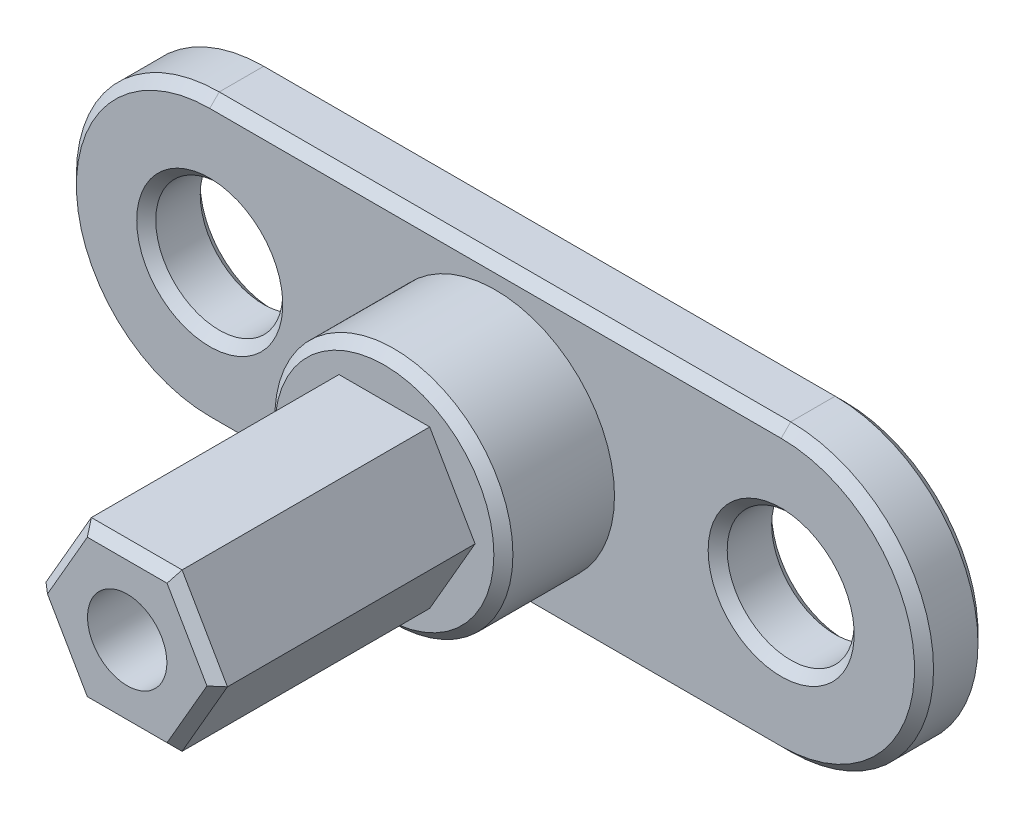
ISO-10303-21;
HEADER;
FILE_DESCRIPTION(('STEP AP214'),'2;1');
FILE_NAME('part.step','',(''),(''),'','','');
FILE_SCHEMA(('AUTOMOTIVE_DESIGN { 1 0 10303 214 1 1 1 1 }'));
ENDSEC;
DATA;
#1=APPLICATION_CONTEXT('core data for automotive mechanical design processes');
#2=APPLICATION_PROTOCOL_DEFINITION('international standard','automotive_design',2000,#1);
#3=PRODUCT_CONTEXT('',#1,'mechanical');
#4=PRODUCT('Part','Part','',(#3));
#5=PRODUCT_RELATED_PRODUCT_CATEGORY('part','',(#4));
#6=PRODUCT_DEFINITION_FORMATION('','',#4);
#7=PRODUCT_DEFINITION_CONTEXT('part definition',#1,'design');
#8=PRODUCT_DEFINITION('design','',#6,#7);
#9=PRODUCT_DEFINITION_SHAPE('','',#8);
#10=(LENGTH_UNIT() NAMED_UNIT(*) SI_UNIT(.MILLI.,.METRE.));
#11=(NAMED_UNIT(*) PLANE_ANGLE_UNIT() SI_UNIT($,.RADIAN.));
#12=(NAMED_UNIT(*) SI_UNIT($,.STERADIAN.) SOLID_ANGLE_UNIT());
#13=UNCERTAINTY_MEASURE_WITH_UNIT(LENGTH_MEASURE(1.E-05),#10,'distance_accuracy_value','');
#14=(GEOMETRIC_REPRESENTATION_CONTEXT(3) GLOBAL_UNCERTAINTY_ASSIGNED_CONTEXT((#13)) GLOBAL_UNIT_ASSIGNED_CONTEXT((#10,
#11,#12)) REPRESENTATION_CONTEXT('',''));
#15=CARTESIAN_POINT('',(0.,0.,0.));
#16=DIRECTION('',(0.,0.,1.));
#17=DIRECTION('',(1.,0.,0.));
#18=AXIS2_PLACEMENT_3D('',#15,#16,#17);
#19=CARTESIAN_POINT('',(-2.85788383248864,-4.95,16.2));
#20=DIRECTION('',(0.,1.,0.));
#21=DIRECTION('',(-1.,0.,0.));
#22=AXIS2_PLACEMENT_3D('',#19,#20,#21);
#23=PLANE('',#22);
#24=DIRECTION('',(0.,0.,-1.));
#25=VECTOR('',#24,1.);
#26=CARTESIAN_POINT('',(2.85788383248865,-4.95,16.2));
#27=LINE('',#26,#25);
#28=CARTESIAN_POINT('',(2.85788383248865,-4.95,15.6));
#29=VERTEX_POINT('',#28);
#30=CARTESIAN_POINT('',(2.85788383248865,-4.95,0.));
#31=VERTEX_POINT('',#30);
#32=EDGE_CURVE('E161',#29,#31,#27,.T.);
#33=ORIENTED_EDGE('',*,*,#32,.F.);
#34=DIRECTION('',(-1.,0.,0.));
#35=VECTOR('',#34,1.);
#36=CARTESIAN_POINT('',(-2.85788383248864,-4.95,15.6));
#37=LINE('',#36,#35);
#38=CARTESIAN_POINT('',(-2.85788383248864,-4.95,15.6));
#39=VERTEX_POINT('',#38);
#40=EDGE_CURVE('E233',#29,#39,#37,.T.);
#41=ORIENTED_EDGE('',*,*,#40,.T.);
#42=DIRECTION('',(0.,0.,-1.));
#43=VECTOR('',#42,1.);
#44=CARTESIAN_POINT('',(-2.85788383248864,-4.95,16.2));
#45=LINE('',#44,#43);
#46=CARTESIAN_POINT('',(-2.85788383248864,-4.95,0.));
#47=VERTEX_POINT('',#46);
#48=EDGE_CURVE('E186',#39,#47,#45,.T.);
#49=ORIENTED_EDGE('',*,*,#48,.T.);
#50=DIRECTION('',(1.,0.,0.));
#51=VECTOR('',#50,1.);
#52=CARTESIAN_POINT('',(-2.85788383248864,-4.95,0.));
#53=LINE('',#52,#51);
#54=EDGE_CURVE('E179',#47,#31,#53,.T.);
#55=ORIENTED_EDGE('',*,*,#54,.T.);
#56=EDGE_LOOP('',(#33,#41,#49,#55));
#57=FACE_BOUND('',#56,.T.);
#58=ADVANCED_FACE('F39',(#57),#23,.F.);
#59=CARTESIAN_POINT('',(2.85788383248865,-4.95,16.2));
#60=DIRECTION('',(-0.866025403784439,0.5,0.));
#61=DIRECTION('',(-0.5,-0.866025403784439,0.));
#62=AXIS2_PLACEMENT_3D('',#59,#60,#61);
#63=PLANE('',#62);
#64=DIRECTION('',(0.,0.,-1.));
#65=VECTOR('',#64,1.);
#66=CARTESIAN_POINT('',(5.7157676649773,0.,16.2));
#67=LINE('',#66,#65);
#68=CARTESIAN_POINT('',(5.7157676649773,0.,15.6));
#69=VERTEX_POINT('',#68);
#70=CARTESIAN_POINT('',(5.7157676649773,0.,0.));
#71=VERTEX_POINT('',#70);
#72=EDGE_CURVE('E172',#69,#71,#67,.T.);
#73=ORIENTED_EDGE('',*,*,#72,.F.);
#74=DIRECTION('',(-0.5,-0.866025403784439,0.));
#75=VECTOR('',#74,1.);
#76=CARTESIAN_POINT('',(2.85788383248865,-4.95,15.6));
#77=LINE('',#76,#75);
#78=EDGE_CURVE('E167',#69,#29,#77,.T.);
#79=ORIENTED_EDGE('',*,*,#78,.T.);
#80=ORIENTED_EDGE('',*,*,#32,.T.);
#81=DIRECTION('',(0.5,0.866025403784439,0.));
#82=VECTOR('',#81,1.);
#83=CARTESIAN_POINT('',(2.85788383248865,-4.95,0.));
#84=LINE('',#83,#82);
#85=EDGE_CURVE('E165',#31,#71,#84,.T.);
#86=ORIENTED_EDGE('',*,*,#85,.T.);
#87=EDGE_LOOP('',(#73,#79,#80,#86));
#88=FACE_BOUND('',#87,.T.);
#89=ADVANCED_FACE('F164',(#88),#63,.F.);
#90=CARTESIAN_POINT('',(5.7157676649773,0.,16.2));
#91=DIRECTION('',(-0.866025403784439,-0.5,0.));
#92=DIRECTION('',(0.5,-0.866025403784439,0.));
#93=AXIS2_PLACEMENT_3D('',#90,#91,#92);
#94=PLANE('',#93);
#95=DIRECTION('',(0.,0.,-1.));
#96=VECTOR('',#95,1.);
#97=CARTESIAN_POINT('',(2.85788383248865,4.95,16.2));
#98=LINE('',#97,#96);
#99=CARTESIAN_POINT('',(2.85788383248865,4.95,15.6));
#100=VERTEX_POINT('',#99);
#101=CARTESIAN_POINT('',(2.85788383248865,4.95,0.));
#102=VERTEX_POINT('',#101);
#103=EDGE_CURVE('E208',#100,#102,#98,.T.);
#104=ORIENTED_EDGE('',*,*,#103,.F.);
#105=DIRECTION('',(0.5,-0.866025403784439,0.));
#106=VECTOR('',#105,1.);
#107=CARTESIAN_POINT('',(5.7157676649773,0.,15.6));
#108=LINE('',#107,#106);
#109=EDGE_CURVE('E230',#100,#69,#108,.T.);
#110=ORIENTED_EDGE('',*,*,#109,.T.);
#111=ORIENTED_EDGE('',*,*,#72,.T.);
#112=DIRECTION('',(-0.5,0.866025403784439,0.));
#113=VECTOR('',#112,1.);
#114=CARTESIAN_POINT('',(5.7157676649773,0.,0.));
#115=LINE('',#114,#113);
#116=EDGE_CURVE('E183',#71,#102,#115,.T.);
#117=ORIENTED_EDGE('',*,*,#116,.T.);
#118=EDGE_LOOP('',(#104,#110,#111,#117));
#119=FACE_BOUND('',#118,.T.);
#120=ADVANCED_FACE('F405',(#119),#94,.F.);
#121=CARTESIAN_POINT('',(2.85788383248865,4.95,16.2));
#122=DIRECTION('',(0.,-1.,0.));
#123=DIRECTION('',(0.,0.,-1.));
#124=AXIS2_PLACEMENT_3D('',#121,#122,#123);
#125=PLANE('',#124);
#126=DIRECTION('',(0.,0.,-1.));
#127=VECTOR('',#126,1.);
#128=CARTESIAN_POINT('',(-2.85788383248865,4.95,16.2));
#129=LINE('',#128,#127);
#130=CARTESIAN_POINT('',(-2.85788383248865,4.95,15.6));
#131=VERTEX_POINT('',#130);
#132=CARTESIAN_POINT('',(-2.85788383248865,4.95,0.));
#133=VERTEX_POINT('',#132);
#134=EDGE_CURVE('E206',#131,#133,#129,.T.);
#135=ORIENTED_EDGE('',*,*,#134,.F.);
#136=DIRECTION('',(1.,0.,0.));
#137=VECTOR('',#136,1.);
#138=CARTESIAN_POINT('',(2.85788383248865,4.95,15.6));
#139=LINE('',#138,#137);
#140=EDGE_CURVE('E228',#131,#100,#139,.T.);
#141=ORIENTED_EDGE('',*,*,#140,.T.);
#142=ORIENTED_EDGE('',*,*,#103,.T.);
#143=DIRECTION('',(-1.,0.,0.));
#144=VECTOR('',#143,1.);
#145=CARTESIAN_POINT('',(2.85788383248865,4.95,0.));
#146=LINE('',#145,#144);
#147=EDGE_CURVE('E195',#102,#133,#146,.T.);
#148=ORIENTED_EDGE('',*,*,#147,.T.);
#149=EDGE_LOOP('',(#135,#141,#142,#148));
#150=FACE_BOUND('',#149,.T.);
#151=ADVANCED_FACE('F691',(#150),#125,.F.);
#152=CARTESIAN_POINT('',(-2.85788383248865,4.95,16.2));
#153=DIRECTION('',(0.866025403784439,-0.5,0.));
#154=DIRECTION('',(0.5,0.866025403784439,0.));
#155=AXIS2_PLACEMENT_3D('',#152,#153,#154);
#156=PLANE('',#155);
#157=DIRECTION('',(0.,0.,-1.));
#158=VECTOR('',#157,1.);
#159=CARTESIAN_POINT('',(-5.7157676649773,0.,16.2));
#160=LINE('',#159,#158);
#161=CARTESIAN_POINT('',(-5.7157676649773,0.,15.6));
#162=VERTEX_POINT('',#161);
#163=CARTESIAN_POINT('',(-5.7157676649773,0.,0.));
#164=VERTEX_POINT('',#163);
#165=EDGE_CURVE('E204',#162,#164,#160,.T.);
#166=ORIENTED_EDGE('',*,*,#165,.F.);
#167=DIRECTION('',(0.5,0.866025403784439,0.));
#168=VECTOR('',#167,1.);
#169=CARTESIAN_POINT('',(-2.85788383248865,4.95,15.6));
#170=LINE('',#169,#168);
#171=EDGE_CURVE('E226',#162,#131,#170,.T.);
#172=ORIENTED_EDGE('',*,*,#171,.T.);
#173=ORIENTED_EDGE('',*,*,#134,.T.);
#174=DIRECTION('',(-0.5,-0.866025403784439,0.));
#175=VECTOR('',#174,1.);
#176=CARTESIAN_POINT('',(-2.85788383248865,4.95,0.));
#177=LINE('',#176,#175);
#178=EDGE_CURVE('E198',#133,#164,#177,.T.);
#179=ORIENTED_EDGE('',*,*,#178,.T.);
#180=EDGE_LOOP('',(#166,#172,#173,#179));
#181=FACE_BOUND('',#180,.T.);
#182=ADVANCED_FACE('F680',(#181),#156,.F.);
#183=CARTESIAN_POINT('',(-5.7157676649773,0.,16.2));
#184=DIRECTION('',(0.866025403784438,0.5,0.));
#185=DIRECTION('',(-0.5,0.866025403784438,0.));
#186=AXIS2_PLACEMENT_3D('',#183,#184,#185);
#187=PLANE('',#186);
#188=ORIENTED_EDGE('',*,*,#48,.F.);
#189=DIRECTION('',(-0.5,0.866025403784438,0.));
#190=VECTOR('',#189,1.);
#191=CARTESIAN_POINT('',(-5.7157676649773,0.,15.6));
#192=LINE('',#191,#190);
#193=EDGE_CURVE('E223',#39,#162,#192,.T.);
#194=ORIENTED_EDGE('',*,*,#193,.T.);
#195=ORIENTED_EDGE('',*,*,#165,.T.);
#196=DIRECTION('',(0.5,-0.866025403784438,0.));
#197=VECTOR('',#196,1.);
#198=CARTESIAN_POINT('',(-5.7157676649773,0.,0.));
#199=LINE('',#198,#197);
#200=EDGE_CURVE('E201',#164,#47,#199,.T.);
#201=ORIENTED_EDGE('',*,*,#200,.T.);
#202=EDGE_LOOP('',(#188,#194,#195,#201));
#203=FACE_BOUND('',#202,.T.);
#204=ADVANCED_FACE('F675',(#203),#187,.F.);
#205=CARTESIAN_POINT('',(0.,0.,16.2));
#206=DIRECTION('',(0.,0.,1.));
#207=DIRECTION('',(1.,0.,0.));
#208=AXIS2_PLACEMENT_3D('',#205,#206,#207);
#209=PLANE('',#208);
#210=CARTESIAN_POINT('',(0.,0.,16.2));
#211=DIRECTION('',(0.,0.,1.));
#212=DIRECTION('',(1.,0.,0.));
#213=AXIS2_PLACEMENT_3D('',#210,#211,#212);
#214=CIRCLE('',#213,2.5);
#215=CARTESIAN_POINT('',(2.5,0.,16.2));
#216=VERTEX_POINT('',#215);
#217=EDGE_CURVE('E364',#216,#216,#214,.T.);
#218=ORIENTED_EDGE('',*,*,#217,.F.);
#219=EDGE_LOOP('',(#218));
#220=FACE_BOUND('',#219,.T.);
#221=DIRECTION('',(-0.5,-0.866025403784439,0.));
#222=VECTOR('',#221,1.);
#223=CARTESIAN_POINT('',(-5.19615242270663,-0.300000000000002,16.2));
#224=LINE('',#223,#222);
#225=CARTESIAN_POINT('',(-2.51147367097487,4.35,16.2));
#226=VERTEX_POINT('',#225);
#227=CARTESIAN_POINT('',(-5.02294734194974,0.,16.2));
#228=VERTEX_POINT('',#227);
#229=EDGE_CURVE('E218',#226,#228,#224,.T.);
#230=ORIENTED_EDGE('',*,*,#229,.T.);
#231=DIRECTION('',(0.5,-0.866025403784439,0.));
#232=VECTOR('',#231,1.);
#233=CARTESIAN_POINT('',(-2.33826859021798,-4.65,16.2));
#234=LINE('',#233,#232);
#235=CARTESIAN_POINT('',(-2.51147367097487,-4.35,16.2));
#236=VERTEX_POINT('',#235);
#237=EDGE_CURVE('E220',#228,#236,#234,.T.);
#238=ORIENTED_EDGE('',*,*,#237,.T.);
#239=DIRECTION('',(1.,0.,0.));
#240=VECTOR('',#239,1.);
#241=CARTESIAN_POINT('',(2.85788383248865,-4.35,16.2));
#242=LINE('',#241,#240);
#243=CARTESIAN_POINT('',(2.51147367097487,-4.35,16.2));
#244=VERTEX_POINT('',#243);
#245=EDGE_CURVE('E171',#236,#244,#242,.T.);
#246=ORIENTED_EDGE('',*,*,#245,.T.);
#247=DIRECTION('',(0.5,0.866025403784439,0.));
#248=VECTOR('',#247,1.);
#249=CARTESIAN_POINT('',(5.19615242270663,0.300000000000003,16.2));
#250=LINE('',#249,#248);
#251=CARTESIAN_POINT('',(5.02294734194974,0.,16.2));
#252=VERTEX_POINT('',#251);
#253=EDGE_CURVE('E212',#244,#252,#250,.T.);
#254=ORIENTED_EDGE('',*,*,#253,.T.);
#255=DIRECTION('',(-0.5,0.866025403784439,0.));
#256=VECTOR('',#255,1.);
#257=CARTESIAN_POINT('',(2.33826859021798,4.65,16.2));
#258=LINE('',#257,#256);
#259=CARTESIAN_POINT('',(2.51147367097487,4.35,16.2));
#260=VERTEX_POINT('',#259);
#261=EDGE_CURVE('E214',#252,#260,#258,.T.);
#262=ORIENTED_EDGE('',*,*,#261,.T.);
#263=DIRECTION('',(-1.,0.,0.));
#264=VECTOR('',#263,1.);
#265=CARTESIAN_POINT('',(-2.85788383248865,4.35,16.2));
#266=LINE('',#265,#264);
#267=EDGE_CURVE('E216',#260,#226,#266,.T.);
#268=ORIENTED_EDGE('',*,*,#267,.T.);
#269=EDGE_LOOP('',(#230,#238,#246,#254,#262,#268));
#270=FACE_BOUND('',#269,.T.);
#271=ADVANCED_FACE('F666',(#220,#270),#209,.T.);
#272=CARTESIAN_POINT('',(0.,0.,0.));
#273=DIRECTION('',(0.,0.,1.));
#274=DIRECTION('',(1.,0.,0.));
#275=AXIS2_PLACEMENT_3D('',#272,#273,#274);
#276=PLANE('',#275);
#277=CARTESIAN_POINT('',(0.,0.,0.));
#278=DIRECTION('',(0.,0.,1.));
#279=DIRECTION('',(1.,0.,0.));
#280=AXIS2_PLACEMENT_3D('',#277,#278,#279);
#281=CIRCLE('',#280,6.89999999999999);
#282=CARTESIAN_POINT('',(6.89999999999999,0.,0.));
#283=VERTEX_POINT('',#282);
#284=EDGE_CURVE('E235',#283,#283,#281,.T.);
#285=ORIENTED_EDGE('',*,*,#284,.T.);
#286=EDGE_LOOP('',(#285));
#287=FACE_BOUND('',#286,.T.);
#288=ORIENTED_EDGE('',*,*,#54,.F.);
#289=ORIENTED_EDGE('',*,*,#200,.F.);
#290=ORIENTED_EDGE('',*,*,#178,.F.);
#291=ORIENTED_EDGE('',*,*,#147,.F.);
#292=ORIENTED_EDGE('',*,*,#116,.F.);
#293=ORIENTED_EDGE('',*,*,#85,.F.);
#294=EDGE_LOOP('',(#288,#289,#290,#291,#292,#293));
#295=FACE_BOUND('',#294,.T.);
#296=ADVANCED_FACE('F177',(#287,#295),#276,.T.);
#297=CARTESIAN_POINT('',(0.,0.,-7.));
#298=DIRECTION('',(0.,0.,1.));
#299=DIRECTION('',(1.,0.,0.));
#300=AXIS2_PLACEMENT_3D('',#297,#298,#299);
#301=CYLINDRICAL_SURFACE('',#300,7.5);
#302=CARTESIAN_POINT('',(0.,0.,-0.600000000000006));
#303=DIRECTION('',(0.,0.,1.));
#304=DIRECTION('',(1.,0.,0.));
#305=AXIS2_PLACEMENT_3D('',#302,#303,#304);
#306=CIRCLE('',#305,7.5);
#307=CARTESIAN_POINT('',(7.5,0.,-0.600000000000006));
#308=VERTEX_POINT('',#307);
#309=EDGE_CURVE('E238',#308,#308,#306,.F.);
#310=ORIENTED_EDGE('',*,*,#309,.T.);
#311=EDGE_LOOP('',(#310));
#312=FACE_BOUND('',#311,.T.);
#313=CARTESIAN_POINT('',(0.,0.,-7.));
#314=DIRECTION('',(0.,0.,1.));
#315=DIRECTION('',(1.,0.,0.));
#316=AXIS2_PLACEMENT_3D('',#313,#314,#315);
#317=CIRCLE('',#316,7.5);
#318=CARTESIAN_POINT('',(7.5,0.,-7.));
#319=VERTEX_POINT('',#318);
#320=EDGE_CURVE('E187',#319,#319,#317,.T.);
#321=ORIENTED_EDGE('',*,*,#320,.T.);
#322=EDGE_LOOP('',(#321));
#323=FACE_BOUND('',#322,.T.);
#324=ADVANCED_FACE('F645',(#312,#323),#301,.T.);
#325=CARTESIAN_POINT('',(18.,0.,-11.));
#326=DIRECTION('',(0.,0.,-1.));
#327=DIRECTION('',(-1.,0.,0.));
#328=AXIS2_PLACEMENT_3D('',#325,#326,#327);
#329=PLANE('',#328);
#330=CARTESIAN_POINT('',(18.,0.,-11.));
#331=DIRECTION('',(0.,0.,-1.));
#332=DIRECTION('',(-1.,0.,0.));
#333=AXIS2_PLACEMENT_3D('',#330,#331,#332);
#334=CIRCLE('',#333,4.59999999999998);
#335=CARTESIAN_POINT('',(13.4,0.,-11.));
#336=VERTEX_POINT('',#335);
#337=EDGE_CURVE('E274',#336,#336,#334,.F.);
#338=ORIENTED_EDGE('',*,*,#337,.T.);
#339=EDGE_LOOP('',(#338));
#340=FACE_BOUND('',#339,.T.);
#341=CARTESIAN_POINT('',(-18.,0.,-11.));
#342=DIRECTION('',(0.,0.,-1.));
#343=DIRECTION('',(-1.,0.,0.));
#344=AXIS2_PLACEMENT_3D('',#341,#342,#343);
#345=CIRCLE('',#344,4.6);
#346=CARTESIAN_POINT('',(-22.6,0.,-11.));
#347=VERTEX_POINT('',#346);
#348=EDGE_CURVE('E271',#347,#347,#345,.F.);
#349=ORIENTED_EDGE('',*,*,#348,.T.);
#350=EDGE_LOOP('',(#349));
#351=FACE_BOUND('',#350,.T.);
#352=DIRECTION('',(1.,0.,0.));
#353=VECTOR('',#352,1.);
#354=CARTESIAN_POINT('',(18.,8.39999999999999,-11.));
#355=LINE('',#354,#353);
#356=CARTESIAN_POINT('',(-18.,8.4,-11.));
#357=VERTEX_POINT('',#356);
#358=CARTESIAN_POINT('',(18.,8.39999999999999,-11.));
#359=VERTEX_POINT('',#358);
#360=EDGE_CURVE('E264',#357,#359,#355,.T.);
#361=ORIENTED_EDGE('',*,*,#360,.T.);
#362=CARTESIAN_POINT('',(18.,0.,-11.));
#363=DIRECTION('',(0.,0.,-1.));
#364=DIRECTION('',(-1.,0.,0.));
#365=AXIS2_PLACEMENT_3D('',#362,#363,#364);
#366=CIRCLE('',#365,8.39999999999999);
#367=CARTESIAN_POINT('',(18.,-8.39999999999999,-11.));
#368=VERTEX_POINT('',#367);
#369=EDGE_CURVE('E268',#359,#368,#366,.T.);
#370=ORIENTED_EDGE('',*,*,#369,.T.);
#371=DIRECTION('',(-1.,0.,0.));
#372=VECTOR('',#371,1.);
#373=CARTESIAN_POINT('',(-18.,-8.39999999999998,-11.));
#374=LINE('',#373,#372);
#375=CARTESIAN_POINT('',(-18.,-8.39999999999998,-11.));
#376=VERTEX_POINT('',#375);
#377=EDGE_CURVE('E266',#368,#376,#374,.T.);
#378=ORIENTED_EDGE('',*,*,#377,.T.);
#379=CARTESIAN_POINT('',(-18.,0.,-11.));
#380=DIRECTION('',(0.,0.,-1.));
#381=DIRECTION('',(-1.,0.,0.));
#382=AXIS2_PLACEMENT_3D('',#379,#380,#381);
#383=CIRCLE('',#382,8.39999999999999);
#384=EDGE_CURVE('E262',#376,#357,#383,.T.);
#385=ORIENTED_EDGE('',*,*,#384,.T.);
#386=EDGE_LOOP('',(#361,#370,#378,#385));
#387=FACE_BOUND('',#386,.T.);
#388=ADVANCED_FACE('F382',(#340,#351,#387),#329,.T.);
#389=CARTESIAN_POINT('',(18.,0.,-7.));
#390=DIRECTION('',(0.,0.,-1.));
#391=DIRECTION('',(-1.,0.,0.));
#392=AXIS2_PLACEMENT_3D('',#389,#390,#391);
#393=PLANE('',#392);
#394=CARTESIAN_POINT('',(18.,0.,-7.));
#395=DIRECTION('',(0.,0.,-1.));
#396=DIRECTION('',(-1.,0.,0.));
#397=AXIS2_PLACEMENT_3D('',#394,#395,#396);
#398=CIRCLE('',#397,4.60000000000001);
#399=CARTESIAN_POINT('',(13.4,0.,-7.));
#400=VERTEX_POINT('',#399);
#401=EDGE_CURVE('E253',#400,#400,#398,.T.);
#402=ORIENTED_EDGE('',*,*,#401,.T.);
#403=EDGE_LOOP('',(#402));
#404=FACE_BOUND('',#403,.T.);
#405=CARTESIAN_POINT('',(-18.,0.,-7.));
#406=DIRECTION('',(0.,0.,-1.));
#407=DIRECTION('',(-1.,0.,0.));
#408=AXIS2_PLACEMENT_3D('',#405,#406,#407);
#409=CIRCLE('',#408,4.6);
#410=CARTESIAN_POINT('',(-22.6,0.,-7.));
#411=VERTEX_POINT('',#410);
#412=EDGE_CURVE('E250',#411,#411,#409,.T.);
#413=ORIENTED_EDGE('',*,*,#412,.T.);
#414=EDGE_LOOP('',(#413));
#415=FACE_BOUND('',#414,.T.);
#416=CARTESIAN_POINT('',(18.,0.,-7.));
#417=DIRECTION('',(0.,0.,-1.));
#418=DIRECTION('',(-1.,0.,0.));
#419=AXIS2_PLACEMENT_3D('',#416,#417,#418);
#420=CIRCLE('',#419,8.4);
#421=CARTESIAN_POINT('',(18.,-8.4,-7.));
#422=VERTEX_POINT('',#421);
#423=CARTESIAN_POINT('',(18.,8.4,-7.));
#424=VERTEX_POINT('',#423);
#425=EDGE_CURVE('E245',#422,#424,#420,.F.);
#426=ORIENTED_EDGE('',*,*,#425,.T.);
#427=DIRECTION('',(-1.,0.,0.));
#428=VECTOR('',#427,1.);
#429=CARTESIAN_POINT('',(18.,8.4,-7.));
#430=LINE('',#429,#428);
#431=CARTESIAN_POINT('',(-18.,8.40000000000001,-7.));
#432=VERTEX_POINT('',#431);
#433=EDGE_CURVE('E247',#424,#432,#430,.T.);
#434=ORIENTED_EDGE('',*,*,#433,.T.);
#435=CARTESIAN_POINT('',(-18.,0.,-7.));
#436=DIRECTION('',(0.,0.,-1.));
#437=DIRECTION('',(-1.,0.,0.));
#438=AXIS2_PLACEMENT_3D('',#435,#436,#437);
#439=CIRCLE('',#438,8.4);
#440=CARTESIAN_POINT('',(-18.,-8.4,-7.));
#441=VERTEX_POINT('',#440);
#442=EDGE_CURVE('E243',#432,#441,#439,.F.);
#443=ORIENTED_EDGE('',*,*,#442,.T.);
#444=DIRECTION('',(1.,0.,0.));
#445=VECTOR('',#444,1.);
#446=CARTESIAN_POINT('',(18.,-8.4,-7.));
#447=LINE('',#446,#445);
#448=EDGE_CURVE('E241',#441,#422,#447,.T.);
#449=ORIENTED_EDGE('',*,*,#448,.T.);
#450=EDGE_LOOP('',(#426,#434,#443,#449));
#451=FACE_BOUND('',#450,.T.);
#452=ORIENTED_EDGE('',*,*,#320,.F.);
#453=EDGE_LOOP('',(#452));
#454=FACE_BOUND('',#453,.T.);
#455=ADVANCED_FACE('F344',(#404,#415,#451,#454),#393,.F.);
#456=CARTESIAN_POINT('',(18.,0.,-11.));
#457=DIRECTION('',(0.,0.,1.));
#458=DIRECTION('',(1.,0.,0.));
#459=AXIS2_PLACEMENT_3D('',#456,#457,#458);
#460=CYLINDRICAL_SURFACE('',#459,9.);
#461=DIRECTION('',(0.,0.,1.));
#462=VECTOR('',#461,1.);
#463=CARTESIAN_POINT('',(18.,-9.,-11.));
#464=LINE('',#463,#462);
#465=CARTESIAN_POINT('',(18.,-9.,-10.4));
#466=VERTEX_POINT('',#465);
#467=CARTESIAN_POINT('',(18.,-9.,-7.6));
#468=VERTEX_POINT('',#467);
#469=EDGE_CURVE('E190',#466,#468,#464,.T.);
#470=ORIENTED_EDGE('',*,*,#469,.F.);
#471=CARTESIAN_POINT('',(18.,0.,-10.4));
#472=DIRECTION('',(0.,0.,-1.));
#473=DIRECTION('',(-1.,0.,0.));
#474=AXIS2_PLACEMENT_3D('',#471,#472,#473);
#475=CIRCLE('',#474,9.);
#476=CARTESIAN_POINT('',(18.,9.,-10.4));
#477=VERTEX_POINT('',#476);
#478=EDGE_CURVE('E285',#466,#477,#475,.F.);
#479=ORIENTED_EDGE('',*,*,#478,.T.);
#480=DIRECTION('',(0.,0.,1.));
#481=VECTOR('',#480,1.);
#482=CARTESIAN_POINT('',(18.,9.,-11.));
#483=LINE('',#482,#481);
#484=CARTESIAN_POINT('',(18.,9.,-7.6));
#485=VERTEX_POINT('',#484);
#486=EDGE_CURVE('E314',#477,#485,#483,.T.);
#487=ORIENTED_EDGE('',*,*,#486,.T.);
#488=CARTESIAN_POINT('',(18.,0.,-7.6));
#489=DIRECTION('',(0.,0.,-1.));
#490=DIRECTION('',(-1.,0.,0.));
#491=AXIS2_PLACEMENT_3D('',#488,#489,#490);
#492=CIRCLE('',#491,9.);
#493=EDGE_CURVE('E283',#485,#468,#492,.T.);
#494=ORIENTED_EDGE('',*,*,#493,.T.);
#495=EDGE_LOOP('',(#470,#479,#487,#494));
#496=FACE_BOUND('',#495,.T.);
#497=ADVANCED_FACE('F358',(#496),#460,.T.);
#498=CARTESIAN_POINT('',(18.,-9.,-11.));
#499=DIRECTION('',(0.,1.,0.));
#500=DIRECTION('',(-1.,0.,0.));
#501=AXIS2_PLACEMENT_3D('',#498,#499,#500);
#502=PLANE('',#501);
#503=DIRECTION('',(0.,0.,1.));
#504=VECTOR('',#503,1.);
#505=CARTESIAN_POINT('',(-18.,-8.99999999999999,-11.));
#506=LINE('',#505,#504);
#507=CARTESIAN_POINT('',(-18.,-8.99999999999999,-10.4));
#508=VERTEX_POINT('',#507);
#509=CARTESIAN_POINT('',(-18.,-8.99999999999999,-7.6));
#510=VERTEX_POINT('',#509);
#511=EDGE_CURVE('E361',#508,#510,#506,.T.);
#512=ORIENTED_EDGE('',*,*,#511,.F.);
#513=DIRECTION('',(1.,0.,0.));
#514=VECTOR('',#513,1.);
#515=CARTESIAN_POINT('',(18.,-9.,-10.4));
#516=LINE('',#515,#514);
#517=EDGE_CURVE('E290',#508,#466,#516,.T.);
#518=ORIENTED_EDGE('',*,*,#517,.T.);
#519=ORIENTED_EDGE('',*,*,#469,.T.);
#520=DIRECTION('',(-1.,0.,0.));
#521=VECTOR('',#520,1.);
#522=CARTESIAN_POINT('',(18.,-9.,-7.6));
#523=LINE('',#522,#521);
#524=EDGE_CURVE('E288',#468,#510,#523,.T.);
#525=ORIENTED_EDGE('',*,*,#524,.T.);
#526=EDGE_LOOP('',(#512,#518,#519,#525));
#527=FACE_BOUND('',#526,.T.);
#528=ADVANCED_FACE('F369',(#527),#502,.F.);
#529=CARTESIAN_POINT('',(-18.,0.,-11.));
#530=DIRECTION('',(0.,0.,1.));
#531=DIRECTION('',(1.,0.,0.));
#532=AXIS2_PLACEMENT_3D('',#529,#530,#531);
#533=CYLINDRICAL_SURFACE('',#532,9.);
#534=DIRECTION('',(0.,0.,1.));
#535=VECTOR('',#534,1.);
#536=CARTESIAN_POINT('',(-18.,9.00000000000001,-11.));
#537=LINE('',#536,#535);
#538=CARTESIAN_POINT('',(-18.,9.00000000000001,-10.4));
#539=VERTEX_POINT('',#538);
#540=CARTESIAN_POINT('',(-18.,9.00000000000001,-7.6));
#541=VERTEX_POINT('',#540);
#542=EDGE_CURVE('E357',#539,#541,#537,.T.);
#543=ORIENTED_EDGE('',*,*,#542,.F.);
#544=CARTESIAN_POINT('',(-18.,0.,-10.4));
#545=DIRECTION('',(0.,0.,-1.));
#546=DIRECTION('',(-1.,0.,0.));
#547=AXIS2_PLACEMENT_3D('',#544,#545,#546);
#548=CIRCLE('',#547,9.);
#549=EDGE_CURVE('E11',#539,#508,#548,.F.);
#550=ORIENTED_EDGE('',*,*,#549,.T.);
#551=ORIENTED_EDGE('',*,*,#511,.T.);
#552=CARTESIAN_POINT('',(-18.,0.,-7.6));
#553=DIRECTION('',(0.,0.,-1.));
#554=DIRECTION('',(-1.,0.,0.));
#555=AXIS2_PLACEMENT_3D('',#552,#553,#554);
#556=CIRCLE('',#555,9.);
#557=EDGE_CURVE('E49',#510,#541,#556,.T.);
#558=ORIENTED_EDGE('',*,*,#557,.T.);
#559=EDGE_LOOP('',(#543,#550,#551,#558));
#560=FACE_BOUND('',#559,.T.);
#561=ADVANCED_FACE('F390',(#560),#533,.T.);
#562=CARTESIAN_POINT('',(18.,9.,-11.));
#563=DIRECTION('',(0.,-1.,0.));
#564=DIRECTION('',(1.,0.,0.));
#565=AXIS2_PLACEMENT_3D('',#562,#563,#564);
#566=PLANE('',#565);
#567=ORIENTED_EDGE('',*,*,#486,.F.);
#568=DIRECTION('',(-1.,0.,0.));
#569=VECTOR('',#568,1.);
#570=CARTESIAN_POINT('',(-18.,9.00000000000001,-10.4));
#571=LINE('',#570,#569);
#572=EDGE_CURVE('E63',#477,#539,#571,.T.);
#573=ORIENTED_EDGE('',*,*,#572,.T.);
#574=ORIENTED_EDGE('',*,*,#542,.T.);
#575=DIRECTION('',(1.,0.,0.));
#576=VECTOR('',#575,1.);
#577=CARTESIAN_POINT('',(18.,9.,-7.6));
#578=LINE('',#577,#576);
#579=EDGE_CURVE('E292',#541,#485,#578,.T.);
#580=ORIENTED_EDGE('',*,*,#579,.T.);
#581=EDGE_LOOP('',(#567,#573,#574,#580));
#582=FACE_BOUND('',#581,.T.);
#583=ADVANCED_FACE('F356',(#582),#566,.F.);
#584=CARTESIAN_POINT('',(18.,0.,-11.));
#585=DIRECTION('',(0.,0.,1.));
#586=DIRECTION('',(1.,0.,0.));
#587=AXIS2_PLACEMENT_3D('',#584,#585,#586);
#588=CYLINDRICAL_SURFACE('',#587,4.);
#589=CARTESIAN_POINT('',(18.,0.,-7.60000000000001));
#590=DIRECTION('',(0.,0.,-1.));
#591=DIRECTION('',(-1.,0.,0.));
#592=AXIS2_PLACEMENT_3D('',#589,#590,#591);
#593=CIRCLE('',#592,4.);
#594=CARTESIAN_POINT('',(14.,0.,-7.60000000000001));
#595=VERTEX_POINT('',#594);
#596=EDGE_CURVE('E259',#595,#595,#593,.F.);
#597=ORIENTED_EDGE('',*,*,#596,.T.);
#598=EDGE_LOOP('',(#597));
#599=FACE_BOUND('',#598,.T.);
#600=CARTESIAN_POINT('',(18.,0.,-10.4));
#601=DIRECTION('',(0.,0.,-1.));
#602=DIRECTION('',(-1.,0.,0.));
#603=AXIS2_PLACEMENT_3D('',#600,#601,#602);
#604=CIRCLE('',#603,4.);
#605=CARTESIAN_POINT('',(14.,0.,-10.4));
#606=VERTEX_POINT('',#605);
#607=EDGE_CURVE('E256',#606,#606,#604,.T.);
#608=ORIENTED_EDGE('',*,*,#607,.T.);
#609=EDGE_LOOP('',(#608));
#610=FACE_BOUND('',#609,.T.);
#611=ADVANCED_FACE('F397',(#599,#610),#588,.F.);
#612=CARTESIAN_POINT('',(-18.,0.,-11.));
#613=DIRECTION('',(0.,0.,1.));
#614=DIRECTION('',(1.,0.,0.));
#615=AXIS2_PLACEMENT_3D('',#612,#613,#614);
#616=CYLINDRICAL_SURFACE('',#615,4.);
#617=CARTESIAN_POINT('',(-18.,0.,-10.4));
#618=DIRECTION('',(0.,0.,-1.));
#619=DIRECTION('',(-1.,0.,0.));
#620=AXIS2_PLACEMENT_3D('',#617,#618,#619);
#621=CIRCLE('',#620,4.);
#622=CARTESIAN_POINT('',(-22.,0.,-10.4));
#623=VERTEX_POINT('',#622);
#624=EDGE_CURVE('E280',#623,#623,#621,.T.);
#625=ORIENTED_EDGE('',*,*,#624,.T.);
#626=EDGE_LOOP('',(#625));
#627=FACE_BOUND('',#626,.T.);
#628=CARTESIAN_POINT('',(-18.,0.,-7.6));
#629=DIRECTION('',(0.,0.,-1.));
#630=DIRECTION('',(-1.,0.,0.));
#631=AXIS2_PLACEMENT_3D('',#628,#629,#630);
#632=CIRCLE('',#631,4.);
#633=CARTESIAN_POINT('',(-22.,0.,-7.6));
#634=VERTEX_POINT('',#633);
#635=EDGE_CURVE('E277',#634,#634,#632,.F.);
#636=ORIENTED_EDGE('',*,*,#635,.T.);
#637=EDGE_LOOP('',(#636));
#638=FACE_BOUND('',#637,.T.);
#639=ADVANCED_FACE('F452',(#627,#638),#616,.F.);
#640=CARTESIAN_POINT('',(3.7672105064623,2.175,16.2));
#641=DIRECTION('',(0.612372435695794,0.353553390593274,0.707106781186548));
#642=DIRECTION('',(0.5,-0.866025403784439,0.));
#643=AXIS2_PLACEMENT_3D('',#640,#641,#642);
#644=PLANE('',#643);
#645=DIRECTION('',(-0.755928946018455,0.,0.654653670707977));
#646=VECTOR('',#645,1.);
#647=CARTESIAN_POINT('',(4.30538343595692,0.,16.8214285714286));
#648=LINE('',#647,#646);
#649=EDGE_CURVE('E308',#69,#252,#648,.T.);
#650=ORIENTED_EDGE('',*,*,#649,.F.);
#651=ORIENTED_EDGE('',*,*,#109,.F.);
#652=DIRECTION('',(-0.377964473009228,-0.654653670707977,0.654653670707977));
#653=VECTOR('',#652,1.);
#654=CARTESIAN_POINT('',(2.15269171797846,3.72857142857143,16.8214285714286));
#655=LINE('',#654,#653);
#656=EDGE_CURVE('E311',#260,#100,#655,.F.);
#657=ORIENTED_EDGE('',*,*,#656,.F.);
#658=ORIENTED_EDGE('',*,*,#261,.F.);
#659=EDGE_LOOP('',(#650,#651,#657,#658));
#660=FACE_BOUND('',#659,.T.);
#661=ADVANCED_FACE('F446',(#660),#644,.T.);
#662=CARTESIAN_POINT('',(0.,4.35,16.2));
#663=DIRECTION('',(0.,0.707106781186548,0.707106781186548));
#664=DIRECTION('',(1.,0.,0.));
#665=AXIS2_PLACEMENT_3D('',#662,#663,#664);
#666=PLANE('',#665);
#667=ORIENTED_EDGE('',*,*,#656,.T.);
#668=ORIENTED_EDGE('',*,*,#140,.F.);
#669=DIRECTION('',(0.377964473009226,-0.654653670707977,0.654653670707977));
#670=VECTOR('',#669,1.);
#671=CARTESIAN_POINT('',(-2.15269171797846,3.72857142857143,16.8214285714286));
#672=LINE('',#671,#670);
#673=EDGE_CURVE('E305',#226,#131,#672,.F.);
#674=ORIENTED_EDGE('',*,*,#673,.F.);
#675=ORIENTED_EDGE('',*,*,#267,.F.);
#676=EDGE_LOOP('',(#667,#668,#674,#675));
#677=FACE_BOUND('',#676,.T.);
#678=ADVANCED_FACE('F439',(#677),#666,.T.);
#679=CARTESIAN_POINT('',(3.76721050646231,-2.175,16.2));
#680=DIRECTION('',(0.612372435695795,-0.353553390593274,0.707106781186548));
#681=DIRECTION('',(-0.5,-0.866025403784439,0.));
#682=AXIS2_PLACEMENT_3D('',#679,#680,#681);
#683=PLANE('',#682);
#684=ORIENTED_EDGE('',*,*,#649,.T.);
#685=ORIENTED_EDGE('',*,*,#253,.F.);
#686=DIRECTION('',(-0.377964473009227,0.654653670707977,0.654653670707977));
#687=VECTOR('',#686,1.);
#688=CARTESIAN_POINT('',(2.15269171797846,-3.72857142857143,16.8214285714286));
#689=LINE('',#688,#687);
#690=EDGE_CURVE('E302',#29,#244,#689,.T.);
#691=ORIENTED_EDGE('',*,*,#690,.F.);
#692=ORIENTED_EDGE('',*,*,#78,.F.);
#693=EDGE_LOOP('',(#684,#685,#691,#692));
#694=FACE_BOUND('',#693,.T.);
#695=ADVANCED_FACE('F432',(#694),#683,.T.);
#696=CARTESIAN_POINT('',(-3.76721050646231,2.175,16.2));
#697=DIRECTION('',(-0.612372435695795,0.353553390593274,0.707106781186547));
#698=DIRECTION('',(0.5,0.866025403784439,0.));
#699=AXIS2_PLACEMENT_3D('',#696,#697,#698);
#700=PLANE('',#699);
#701=ORIENTED_EDGE('',*,*,#673,.T.);
#702=ORIENTED_EDGE('',*,*,#171,.F.);
#703=DIRECTION('',(0.755928946018454,0.,0.654653670707978));
#704=VECTOR('',#703,1.);
#705=CARTESIAN_POINT('',(-4.30538343595692,0.,16.8214285714286));
#706=LINE('',#705,#704);
#707=EDGE_CURVE('E299',#228,#162,#706,.F.);
#708=ORIENTED_EDGE('',*,*,#707,.F.);
#709=ORIENTED_EDGE('',*,*,#229,.F.);
#710=EDGE_LOOP('',(#701,#702,#708,#709));
#711=FACE_BOUND('',#710,.T.);
#712=ADVANCED_FACE('F425',(#711),#700,.T.);
#713=CARTESIAN_POINT('',(0.,-4.35,16.2));
#714=DIRECTION('',(0.,-0.707106781186548,0.707106781186548));
#715=DIRECTION('',(-1.,0.,0.));
#716=AXIS2_PLACEMENT_3D('',#713,#714,#715);
#717=PLANE('',#716);
#718=ORIENTED_EDGE('',*,*,#690,.T.);
#719=ORIENTED_EDGE('',*,*,#245,.F.);
#720=DIRECTION('',(-0.377964473009227,-0.654653670707977,-0.654653670707977));
#721=VECTOR('',#720,1.);
#722=CARTESIAN_POINT('',(-2.15269171797846,-3.72857142857143,16.8214285714286));
#723=LINE('',#722,#721);
#724=EDGE_CURVE('E297',#39,#236,#723,.F.);
#725=ORIENTED_EDGE('',*,*,#724,.F.);
#726=ORIENTED_EDGE('',*,*,#40,.F.);
#727=EDGE_LOOP('',(#718,#719,#725,#726));
#728=FACE_BOUND('',#727,.T.);
#729=ADVANCED_FACE('F418',(#728),#717,.T.);
#730=CARTESIAN_POINT('',(-3.7672105064623,-2.175,16.2));
#731=DIRECTION('',(-0.612372435695794,-0.353553390593274,0.707106781186547));
#732=DIRECTION('',(-0.5,0.866025403784438,0.));
#733=AXIS2_PLACEMENT_3D('',#730,#731,#732);
#734=PLANE('',#733);
#735=ORIENTED_EDGE('',*,*,#707,.T.);
#736=ORIENTED_EDGE('',*,*,#193,.F.);
#737=ORIENTED_EDGE('',*,*,#724,.T.);
#738=ORIENTED_EDGE('',*,*,#237,.F.);
#739=EDGE_LOOP('',(#735,#736,#737,#738));
#740=FACE_BOUND('',#739,.T.);
#741=ADVANCED_FACE('F410',(#740),#734,.T.);
#742=CARTESIAN_POINT('',(0.,0.,0.));
#743=DIRECTION('',(0.,0.,-1.));
#744=DIRECTION('',(-1.,0.,0.));
#745=AXIS2_PLACEMENT_3D('',#742,#743,#744);
#746=CONICAL_SURFACE('',#745,6.89999999999999,0.785398163397452);
#747=ORIENTED_EDGE('',*,*,#309,.F.);
#748=EDGE_LOOP('',(#747));
#749=FACE_BOUND('',#748,.T.);
#750=ORIENTED_EDGE('',*,*,#284,.F.);
#751=EDGE_LOOP('',(#750));
#752=FACE_BOUND('',#751,.T.);
#753=ADVANCED_FACE('F417',(#749,#752),#746,.T.);
#754=CARTESIAN_POINT('',(18.,0.,-7.));
#755=DIRECTION('',(0.,0.,1.));
#756=DIRECTION('',(1.,0.,0.));
#757=AXIS2_PLACEMENT_3D('',#754,#755,#756);
#758=CONICAL_SURFACE('',#757,4.60000000000001,0.785398163397447);
#759=ORIENTED_EDGE('',*,*,#596,.F.);
#760=EDGE_LOOP('',(#759));
#761=FACE_BOUND('',#760,.T.);
#762=ORIENTED_EDGE('',*,*,#401,.F.);
#763=EDGE_LOOP('',(#762));
#764=FACE_BOUND('',#763,.T.);
#765=ADVANCED_FACE('F459',(#761,#764),#758,.F.);
#766=CARTESIAN_POINT('',(18.,0.,-10.4));
#767=DIRECTION('',(0.,0.,-1.));
#768=DIRECTION('',(-1.,0.,0.));
#769=AXIS2_PLACEMENT_3D('',#766,#767,#768);
#770=CONICAL_SURFACE('',#769,4.,0.785398163397448);
#771=ORIENTED_EDGE('',*,*,#337,.F.);
#772=EDGE_LOOP('',(#771));
#773=FACE_BOUND('',#772,.T.);
#774=ORIENTED_EDGE('',*,*,#607,.F.);
#775=EDGE_LOOP('',(#774));
#776=FACE_BOUND('',#775,.T.);
#777=ADVANCED_FACE('F466',(#773,#776),#770,.F.);
#778=CARTESIAN_POINT('',(-18.,0.,-10.4));
#779=DIRECTION('',(0.,0.,-1.));
#780=DIRECTION('',(-1.,0.,0.));
#781=AXIS2_PLACEMENT_3D('',#778,#779,#780);
#782=CONICAL_SURFACE('',#781,4.,0.785398163397452);
#783=ORIENTED_EDGE('',*,*,#348,.F.);
#784=EDGE_LOOP('',(#783));
#785=FACE_BOUND('',#784,.T.);
#786=ORIENTED_EDGE('',*,*,#624,.F.);
#787=EDGE_LOOP('',(#786));
#788=FACE_BOUND('',#787,.T.);
#789=ADVANCED_FACE('F473',(#785,#788),#782,.F.);
#790=CARTESIAN_POINT('',(-18.,0.,-7.));
#791=DIRECTION('',(0.,0.,1.));
#792=DIRECTION('',(1.,0.,0.));
#793=AXIS2_PLACEMENT_3D('',#790,#791,#792);
#794=CONICAL_SURFACE('',#793,4.6,0.78539816339745);
#795=ORIENTED_EDGE('',*,*,#635,.F.);
#796=EDGE_LOOP('',(#795));
#797=FACE_BOUND('',#796,.T.);
#798=ORIENTED_EDGE('',*,*,#412,.F.);
#799=EDGE_LOOP('',(#798));
#800=FACE_BOUND('',#799,.T.);
#801=ADVANCED_FACE('F480',(#797,#800),#794,.F.);
#802=CARTESIAN_POINT('',(-18.,0.,-11.));
#803=DIRECTION('',(0.,0.,1.));
#804=DIRECTION('',(1.,0.,0.));
#805=AXIS2_PLACEMENT_3D('',#802,#803,#804);
#806=CONICAL_SURFACE('',#805,8.39999999999999,0.785398163397446);
#807=DIRECTION('',(0.,0.707106781186546,-0.70710678118655));
#808=VECTOR('',#807,1.);
#809=CARTESIAN_POINT('',(-18.,-8.99999999999999,-10.4));
#810=LINE('',#809,#808);
#811=EDGE_CURVE('E319',#508,#376,#810,.T.);
#812=ORIENTED_EDGE('',*,*,#811,.F.);
#813=ORIENTED_EDGE('',*,*,#549,.F.);
#814=DIRECTION('',(0.,0.707106781186546,0.70710678118655));
#815=VECTOR('',#814,1.);
#816=CARTESIAN_POINT('',(-18.,8.4,-11.));
#817=LINE('',#816,#815);
#818=EDGE_CURVE('E300',#357,#539,#817,.T.);
#819=ORIENTED_EDGE('',*,*,#818,.F.);
#820=ORIENTED_EDGE('',*,*,#384,.F.);
#821=EDGE_LOOP('',(#812,#813,#819,#820));
#822=FACE_BOUND('',#821,.T.);
#823=ADVANCED_FACE('F389',(#822),#806,.T.);
#824=CARTESIAN_POINT('',(18.,8.39999999999999,-11.));
#825=DIRECTION('',(0.,0.70710678118655,-0.707106781186546));
#826=DIRECTION('',(-1.,0.,0.));
#827=AXIS2_PLACEMENT_3D('',#824,#825,#826);
#828=PLANE('',#827);
#829=ORIENTED_EDGE('',*,*,#818,.T.);
#830=ORIENTED_EDGE('',*,*,#572,.F.);
#831=DIRECTION('',(0.,0.707106781186546,0.70710678118655));
#832=VECTOR('',#831,1.);
#833=CARTESIAN_POINT('',(18.,8.39999999999999,-11.));
#834=LINE('',#833,#832);
#835=EDGE_CURVE('E317',#359,#477,#834,.T.);
#836=ORIENTED_EDGE('',*,*,#835,.F.);
#837=ORIENTED_EDGE('',*,*,#360,.F.);
#838=EDGE_LOOP('',(#829,#830,#836,#837));
#839=FACE_BOUND('',#838,.T.);
#840=ADVANCED_FACE('F386',(#839),#828,.T.);
#841=CARTESIAN_POINT('',(18.,-8.39999999999999,-11.));
#842=DIRECTION('',(0.,-0.70710678118655,-0.707106781186546));
#843=DIRECTION('',(1.,0.,0.));
#844=AXIS2_PLACEMENT_3D('',#841,#842,#843);
#845=PLANE('',#844);
#846=ORIENTED_EDGE('',*,*,#811,.T.);
#847=ORIENTED_EDGE('',*,*,#377,.F.);
#848=DIRECTION('',(0.,0.707106781186546,-0.70710678118655));
#849=VECTOR('',#848,1.);
#850=CARTESIAN_POINT('',(18.,-9.,-10.4));
#851=LINE('',#850,#849);
#852=EDGE_CURVE('E315',#466,#368,#851,.T.);
#853=ORIENTED_EDGE('',*,*,#852,.F.);
#854=ORIENTED_EDGE('',*,*,#517,.F.);
#855=EDGE_LOOP('',(#846,#847,#853,#854));
#856=FACE_BOUND('',#855,.T.);
#857=ADVANCED_FACE('F378',(#856),#845,.T.);
#858=CARTESIAN_POINT('',(18.,0.,-11.));
#859=DIRECTION('',(0.,0.,1.));
#860=DIRECTION('',(1.,0.,0.));
#861=AXIS2_PLACEMENT_3D('',#858,#859,#860);
#862=CONICAL_SURFACE('',#861,8.39999999999999,0.785398163397446);
#863=ORIENTED_EDGE('',*,*,#835,.T.);
#864=ORIENTED_EDGE('',*,*,#478,.F.);
#865=ORIENTED_EDGE('',*,*,#852,.T.);
#866=ORIENTED_EDGE('',*,*,#369,.F.);
#867=EDGE_LOOP('',(#863,#864,#865,#866));
#868=FACE_BOUND('',#867,.T.);
#869=ADVANCED_FACE('F373',(#868),#862,.T.);
#870=CARTESIAN_POINT('',(18.,-9.,-7.6));
#871=DIRECTION('',(0.,0.707106781186547,-0.707106781186547));
#872=DIRECTION('',(-1.,0.,0.));
#873=AXIS2_PLACEMENT_3D('',#870,#871,#872);
#874=PLANE('',#873);
#875=DIRECTION('',(0.,-0.707106781186547,-0.707106781186547));
#876=VECTOR('',#875,1.);
#877=CARTESIAN_POINT('',(18.,-8.4,-7.));
#878=LINE('',#877,#876);
#879=EDGE_CURVE('E328',#422,#468,#878,.T.);
#880=ORIENTED_EDGE('',*,*,#879,.F.);
#881=ORIENTED_EDGE('',*,*,#448,.F.);
#882=DIRECTION('',(0.,0.707106781186547,0.707106781186547));
#883=VECTOR('',#882,1.);
#884=CARTESIAN_POINT('',(-18.,-8.99999999999999,-7.6));
#885=LINE('',#884,#883);
#886=EDGE_CURVE('E44',#510,#441,#885,.T.);
#887=ORIENTED_EDGE('',*,*,#886,.F.);
#888=ORIENTED_EDGE('',*,*,#524,.F.);
#889=EDGE_LOOP('',(#880,#881,#887,#888));
#890=FACE_BOUND('',#889,.T.);
#891=ADVANCED_FACE('F42',(#890),#874,.F.);
#892=CARTESIAN_POINT('',(-18.,0.,-7.6));
#893=DIRECTION('',(0.,0.,-1.));
#894=DIRECTION('',(-1.,0.,0.));
#895=AXIS2_PLACEMENT_3D('',#892,#893,#894);
#896=CONICAL_SURFACE('',#895,9.,0.785398163397448);
#897=ORIENTED_EDGE('',*,*,#886,.T.);
#898=ORIENTED_EDGE('',*,*,#442,.F.);
#899=DIRECTION('',(0.,-0.707106781186547,0.707106781186547));
#900=VECTOR('',#899,1.);
#901=CARTESIAN_POINT('',(-18.,9.00000000000001,-7.6));
#902=LINE('',#901,#900);
#903=EDGE_CURVE('E326',#541,#432,#902,.T.);
#904=ORIENTED_EDGE('',*,*,#903,.F.);
#905=ORIENTED_EDGE('',*,*,#557,.F.);
#906=EDGE_LOOP('',(#897,#898,#904,#905));
#907=FACE_BOUND('',#906,.T.);
#908=ADVANCED_FACE('F338',(#907),#896,.T.);
#909=CARTESIAN_POINT('',(18.,0.,-7.6));
#910=DIRECTION('',(0.,0.,-1.));
#911=DIRECTION('',(-1.,0.,0.));
#912=AXIS2_PLACEMENT_3D('',#909,#910,#911);
#913=CONICAL_SURFACE('',#912,9.,0.785398163397448);
#914=ORIENTED_EDGE('',*,*,#879,.T.);
#915=ORIENTED_EDGE('',*,*,#493,.F.);
#916=DIRECTION('',(0.,0.707106781186547,-0.707106781186547));
#917=VECTOR('',#916,1.);
#918=CARTESIAN_POINT('',(18.,8.4,-7.));
#919=LINE('',#918,#917);
#920=EDGE_CURVE('E324',#424,#485,#919,.T.);
#921=ORIENTED_EDGE('',*,*,#920,.F.);
#922=ORIENTED_EDGE('',*,*,#425,.F.);
#923=EDGE_LOOP('',(#914,#915,#921,#922));
#924=FACE_BOUND('',#923,.T.);
#925=ADVANCED_FACE('F351',(#924),#913,.T.);
#926=CARTESIAN_POINT('',(18.,9.,-7.6));
#927=DIRECTION('',(0.,-0.707106781186547,-0.707106781186547));
#928=DIRECTION('',(1.,0.,0.));
#929=AXIS2_PLACEMENT_3D('',#926,#927,#928);
#930=PLANE('',#929);
#931=ORIENTED_EDGE('',*,*,#903,.T.);
#932=ORIENTED_EDGE('',*,*,#433,.F.);
#933=ORIENTED_EDGE('',*,*,#920,.T.);
#934=ORIENTED_EDGE('',*,*,#579,.F.);
#935=EDGE_LOOP('',(#931,#932,#933,#934));
#936=FACE_BOUND('',#935,.T.);
#937=ADVANCED_FACE('F349',(#936),#930,.F.);
#938=CARTESIAN_POINT('',(0.,0.,-3.8));
#939=DIRECTION('',(0.,0.,1.));
#940=DIRECTION('',(1.,0.,0.));
#941=AXIS2_PLACEMENT_3D('',#938,#939,#940);
#942=CYLINDRICAL_SURFACE('',#941,2.5);
#943=CARTESIAN_POINT('',(0.,0.,-3.8));
#944=DIRECTION('',(0.,0.,1.));
#945=DIRECTION('',(1.,0.,0.));
#946=AXIS2_PLACEMENT_3D('',#943,#944,#945);
#947=CIRCLE('',#946,2.5);
#948=CARTESIAN_POINT('',(2.5,0.,-3.8));
#949=VERTEX_POINT('',#948);
#950=EDGE_CURVE('E327',#949,#949,#947,.T.);
#951=ORIENTED_EDGE('',*,*,#950,.F.);
#952=EDGE_LOOP('',(#951));
#953=FACE_BOUND('',#952,.T.);
#954=ORIENTED_EDGE('',*,*,#217,.T.);
#955=EDGE_LOOP('',(#954));
#956=FACE_BOUND('',#955,.T.);
#957=ADVANCED_FACE('F513',(#953,#956),#942,.F.);
#958=CARTESIAN_POINT('',(0.,0.,-3.8));
#959=DIRECTION('',(0.,0.,1.));
#960=DIRECTION('',(1.,0.,0.));
#961=AXIS2_PLACEMENT_3D('',#958,#959,#960);
#962=PLANE('',#961);
#963=ORIENTED_EDGE('',*,*,#950,.T.);
#964=EDGE_LOOP('',(#963));
#965=FACE_BOUND('',#964,.T.);
#966=ADVANCED_FACE('F843',(#965),#962,.T.);
#967=CLOSED_SHELL('',(#58,#89,#120,#151,#182,#204,#271,#296,#324,#388,#455,#497,#528,#561,#583,
#611,#639,#661,#678,#695,#712,#729,#741,#753,#765,#777,#789,#801,#823,#840,#857,#869,#891,#908,
#925,#937,#957,#966));
#968=MANIFOLD_SOLID_BREP('B2',#967);
#969=ADVANCED_BREP_SHAPE_REPRESENTATION('',(#18,#968),#14);
#970=SHAPE_DEFINITION_REPRESENTATION(#9,#969);
ENDSEC;
END-ISO-10303-21;
